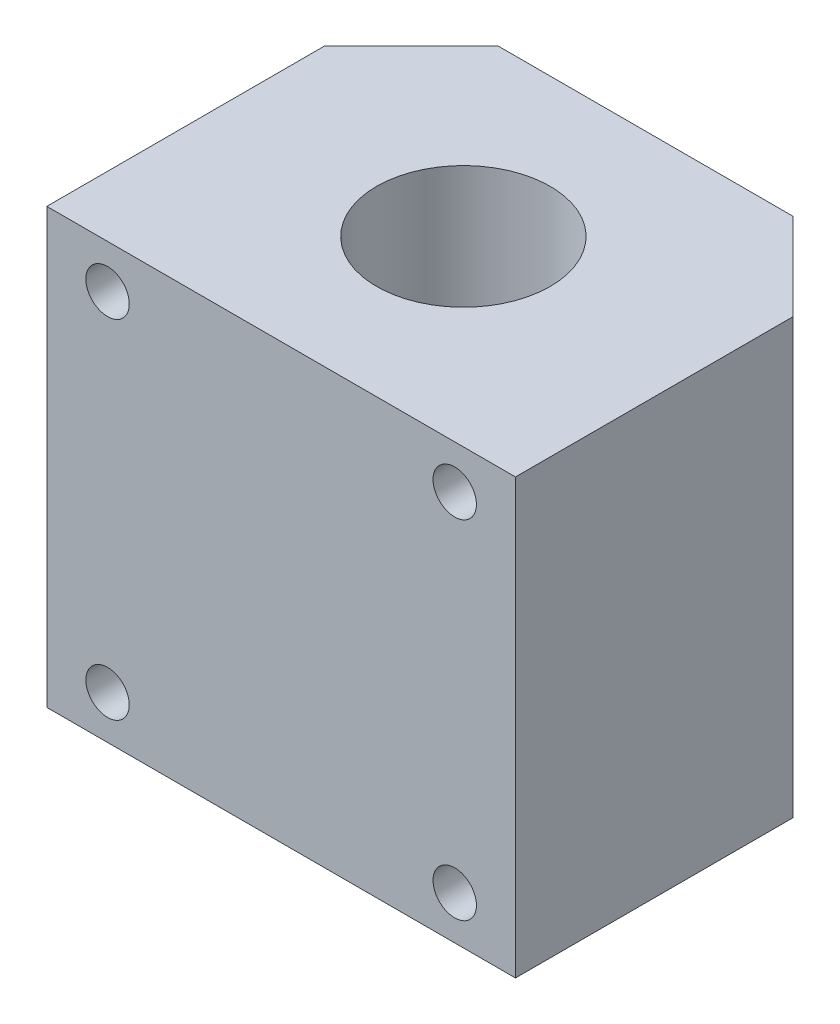
ISO-10303-21;
HEADER;
FILE_DESCRIPTION(('STEP AP214'),'2;1');
FILE_NAME('part.step','',(''),(''),'','','');
FILE_SCHEMA(('AUTOMOTIVE_DESIGN { 1 0 10303 214 1 1 1 1 }'));
ENDSEC;
DATA;
#1=APPLICATION_CONTEXT('core data for automotive mechanical design processes');
#2=APPLICATION_PROTOCOL_DEFINITION('international standard','automotive_design',2000,#1);
#3=PRODUCT_CONTEXT('',#1,'mechanical');
#4=PRODUCT('Part','Part','',(#3));
#5=PRODUCT_RELATED_PRODUCT_CATEGORY('part','',(#4));
#6=PRODUCT_DEFINITION_FORMATION('','',#4);
#7=PRODUCT_DEFINITION_CONTEXT('part definition',#1,'design');
#8=PRODUCT_DEFINITION('design','',#6,#7);
#9=PRODUCT_DEFINITION_SHAPE('','',#8);
#10=(LENGTH_UNIT() NAMED_UNIT(*) SI_UNIT(.MILLI.,.METRE.));
#11=(NAMED_UNIT(*) PLANE_ANGLE_UNIT() SI_UNIT($,.RADIAN.));
#12=(NAMED_UNIT(*) SI_UNIT($,.STERADIAN.) SOLID_ANGLE_UNIT());
#13=UNCERTAINTY_MEASURE_WITH_UNIT(LENGTH_MEASURE(1.E-05),#10,'distance_accuracy_value','');
#14=(GEOMETRIC_REPRESENTATION_CONTEXT(3) GLOBAL_UNCERTAINTY_ASSIGNED_CONTEXT((#13)) GLOBAL_UNIT_ASSIGNED_CONTEXT((#10,
#11,#12)) REPRESENTATION_CONTEXT('',''));
#15=CARTESIAN_POINT('',(0.,0.,0.));
#16=DIRECTION('',(0.,0.,1.));
#17=DIRECTION('',(1.,0.,0.));
#18=AXIS2_PLACEMENT_3D('',#15,#16,#17);
#19=CARTESIAN_POINT('',(-27.,-25.,42.));
#20=DIRECTION('',(1.,0.,0.));
#21=DIRECTION('',(0.,0.,-1.));
#22=AXIS2_PLACEMENT_3D('',#19,#20,#21);
#23=PLANE('',#22);
#24=DIRECTION('',(0.,0.,-1.));
#25=VECTOR('',#24,1.);
#26=CARTESIAN_POINT('',(-27.,25.,42.));
#27=LINE('',#26,#25);
#28=CARTESIAN_POINT('',(-27.,25.,42.));
#29=VERTEX_POINT('',#28);
#30=CARTESIAN_POINT('',(-27.,25.,10.));
#31=VERTEX_POINT('',#30);
#32=EDGE_CURVE('E142',#29,#31,#27,.T.);
#33=ORIENTED_EDGE('',*,*,#32,.T.);
#34=DIRECTION('',(0.,-1.,0.));
#35=VECTOR('',#34,1.);
#36=CARTESIAN_POINT('',(-27.,-25.,10.));
#37=LINE('',#36,#35);
#38=CARTESIAN_POINT('',(-27.,-25.,10.));
#39=VERTEX_POINT('',#38);
#40=EDGE_CURVE('E11',#31,#39,#37,.T.);
#41=ORIENTED_EDGE('',*,*,#40,.T.);
#42=DIRECTION('',(0.,0.,-1.));
#43=VECTOR('',#42,1.);
#44=CARTESIAN_POINT('',(-27.,-25.,42.));
#45=LINE('',#44,#43);
#46=CARTESIAN_POINT('',(-27.,-25.,42.));
#47=VERTEX_POINT('',#46);
#48=EDGE_CURVE('E91',#47,#39,#45,.T.);
#49=ORIENTED_EDGE('',*,*,#48,.F.);
#50=DIRECTION('',(0.,-1.,0.));
#51=VECTOR('',#50,1.);
#52=CARTESIAN_POINT('',(-27.,-25.,42.));
#53=LINE('',#52,#51);
#54=EDGE_CURVE('E97',#29,#47,#53,.T.);
#55=ORIENTED_EDGE('',*,*,#54,.F.);
#56=EDGE_LOOP('',(#33,#41,#49,#55));
#57=FACE_BOUND('',#56,.T.);
#58=ADVANCED_FACE('F32',(#57),#23,.F.);
#59=CARTESIAN_POINT('',(27.,-25.,42.));
#60=DIRECTION('',(0.,1.,0.));
#61=DIRECTION('',(-1.,0.,0.));
#62=AXIS2_PLACEMENT_3D('',#59,#60,#61);
#63=PLANE('',#62);
#64=CARTESIAN_POINT('',(0.,-25.,21.));
#65=DIRECTION('',(0.,1.,0.));
#66=DIRECTION('',(-1.,0.,0.));
#67=AXIS2_PLACEMENT_3D('',#64,#65,#66);
#68=CIRCLE('',#67,10.);
#69=CARTESIAN_POINT('',(-10.,-25.,21.));
#70=VERTEX_POINT('',#69);
#71=EDGE_CURVE('E138',#70,#70,#68,.T.);
#72=ORIENTED_EDGE('',*,*,#71,.T.);
#73=EDGE_LOOP('',(#72));
#74=FACE_BOUND('',#73,.T.);
#75=DIRECTION('',(1.,0.,0.));
#76=VECTOR('',#75,1.);
#77=CARTESIAN_POINT('',(27.,-25.,0.));
#78=LINE('',#77,#76);
#79=CARTESIAN_POINT('',(-17.,-25.,0.));
#80=VERTEX_POINT('',#79);
#81=CARTESIAN_POINT('',(17.,-25.,0.));
#82=VERTEX_POINT('',#81);
#83=EDGE_CURVE('E124',#80,#82,#78,.T.);
#84=ORIENTED_EDGE('',*,*,#83,.T.);
#85=DIRECTION('',(-0.707106781186549,0.,-0.707106781186547));
#86=VECTOR('',#85,1.);
#87=CARTESIAN_POINT('',(27.,-25.,10.));
#88=LINE('',#87,#86);
#89=CARTESIAN_POINT('',(27.,-25.,10.));
#90=VERTEX_POINT('',#89);
#91=EDGE_CURVE('E40',#82,#90,#88,.F.);
#92=ORIENTED_EDGE('',*,*,#91,.T.);
#93=DIRECTION('',(0.,0.,-1.));
#94=VECTOR('',#93,1.);
#95=CARTESIAN_POINT('',(27.,-25.,42.));
#96=LINE('',#95,#94);
#97=CARTESIAN_POINT('',(27.,-25.,42.));
#98=VERTEX_POINT('',#97);
#99=EDGE_CURVE('E93',#98,#90,#96,.T.);
#100=ORIENTED_EDGE('',*,*,#99,.F.);
#101=DIRECTION('',(1.,0.,0.));
#102=VECTOR('',#101,1.);
#103=CARTESIAN_POINT('',(27.,-25.,42.));
#104=LINE('',#103,#102);
#105=EDGE_CURVE('E87',#47,#98,#104,.T.);
#106=ORIENTED_EDGE('',*,*,#105,.F.);
#107=ORIENTED_EDGE('',*,*,#48,.T.);
#108=DIRECTION('',(-0.707106781186549,0.,0.707106781186547));
#109=VECTOR('',#108,1.);
#110=CARTESIAN_POINT('',(-27.,-25.,10.));
#111=LINE('',#110,#109);
#112=EDGE_CURVE('E47',#39,#80,#111,.F.);
#113=ORIENTED_EDGE('',*,*,#112,.T.);
#114=EDGE_LOOP('',(#84,#92,#100,#106,#107,#113));
#115=FACE_BOUND('',#114,.T.);
#116=ADVANCED_FACE('F89',(#74,#115),#63,.F.);
#117=CARTESIAN_POINT('',(27.,-25.,42.));
#118=DIRECTION('',(-1.,0.,0.));
#119=DIRECTION('',(0.,0.,1.));
#120=AXIS2_PLACEMENT_3D('',#117,#118,#119);
#121=PLANE('',#120);
#122=ORIENTED_EDGE('',*,*,#99,.T.);
#123=DIRECTION('',(0.,1.,0.));
#124=VECTOR('',#123,1.);
#125=CARTESIAN_POINT('',(27.,-25.,10.));
#126=LINE('',#125,#124);
#127=CARTESIAN_POINT('',(27.,25.,10.));
#128=VERTEX_POINT('',#127);
#129=EDGE_CURVE('E108',#90,#128,#126,.T.);
#130=ORIENTED_EDGE('',*,*,#129,.T.);
#131=DIRECTION('',(0.,0.,-1.));
#132=VECTOR('',#131,1.);
#133=CARTESIAN_POINT('',(27.,25.,42.));
#134=LINE('',#133,#132);
#135=CARTESIAN_POINT('',(27.,25.,42.));
#136=VERTEX_POINT('',#135);
#137=EDGE_CURVE('E113',#136,#128,#134,.T.);
#138=ORIENTED_EDGE('',*,*,#137,.F.);
#139=DIRECTION('',(0.,1.,0.));
#140=VECTOR('',#139,1.);
#141=CARTESIAN_POINT('',(27.,-25.,42.));
#142=LINE('',#141,#140);
#143=EDGE_CURVE('E96',#98,#136,#142,.T.);
#144=ORIENTED_EDGE('',*,*,#143,.F.);
#145=EDGE_LOOP('',(#122,#130,#138,#144));
#146=FACE_BOUND('',#145,.T.);
#147=ADVANCED_FACE('F128',(#146),#121,.F.);
#148=CARTESIAN_POINT('',(27.,25.,42.));
#149=DIRECTION('',(0.,-1.,0.));
#150=DIRECTION('',(1.,0.,0.));
#151=AXIS2_PLACEMENT_3D('',#148,#149,#150);
#152=PLANE('',#151);
#153=CARTESIAN_POINT('',(0.,25.,21.));
#154=DIRECTION('',(0.,1.,0.));
#155=DIRECTION('',(-1.,0.,0.));
#156=AXIS2_PLACEMENT_3D('',#153,#154,#155);
#157=CIRCLE('',#156,10.);
#158=CARTESIAN_POINT('',(-10.,25.,21.));
#159=VERTEX_POINT('',#158);
#160=EDGE_CURVE('E145',#159,#159,#157,.T.);
#161=ORIENTED_EDGE('',*,*,#160,.F.);
#162=EDGE_LOOP('',(#161));
#163=FACE_BOUND('',#162,.T.);
#164=ORIENTED_EDGE('',*,*,#137,.T.);
#165=DIRECTION('',(0.707106781186549,0.,0.707106781186547));
#166=VECTOR('',#165,1.);
#167=CARTESIAN_POINT('',(27.,25.,10.));
#168=LINE('',#167,#166);
#169=CARTESIAN_POINT('',(17.,25.,0.));
#170=VERTEX_POINT('',#169);
#171=EDGE_CURVE('E118',#128,#170,#168,.F.);
#172=ORIENTED_EDGE('',*,*,#171,.T.);
#173=DIRECTION('',(-1.,0.,0.));
#174=VECTOR('',#173,1.);
#175=CARTESIAN_POINT('',(27.,25.,0.));
#176=LINE('',#175,#174);
#177=CARTESIAN_POINT('',(-17.,25.,0.));
#178=VERTEX_POINT('',#177);
#179=EDGE_CURVE('E106',#170,#178,#176,.T.);
#180=ORIENTED_EDGE('',*,*,#179,.T.);
#181=DIRECTION('',(0.707106781186549,0.,-0.707106781186547));
#182=VECTOR('',#181,1.);
#183=CARTESIAN_POINT('',(-27.,25.,10.));
#184=LINE('',#183,#182);
#185=EDGE_CURVE('E111',#178,#31,#184,.F.);
#186=ORIENTED_EDGE('',*,*,#185,.T.);
#187=ORIENTED_EDGE('',*,*,#32,.F.);
#188=DIRECTION('',(-1.,0.,0.));
#189=VECTOR('',#188,1.);
#190=CARTESIAN_POINT('',(27.,25.,42.));
#191=LINE('',#190,#189);
#192=EDGE_CURVE('E102',#136,#29,#191,.T.);
#193=ORIENTED_EDGE('',*,*,#192,.F.);
#194=EDGE_LOOP('',(#164,#172,#180,#186,#187,#193));
#195=FACE_BOUND('',#194,.T.);
#196=ADVANCED_FACE('F134',(#163,#195),#152,.F.);
#197=CARTESIAN_POINT('',(0.,0.,42.));
#198=DIRECTION('',(0.,0.,1.));
#199=DIRECTION('',(1.,0.,0.));
#200=AXIS2_PLACEMENT_3D('',#197,#198,#199);
#201=PLANE('',#200);
#202=CARTESIAN_POINT('',(20.,-20.,42.));
#203=DIRECTION('',(0.,0.,1.));
#204=DIRECTION('',(1.,0.,0.));
#205=AXIS2_PLACEMENT_3D('',#202,#203,#204);
#206=CIRCLE('',#205,2.5);
#207=CARTESIAN_POINT('',(22.5,-20.,42.));
#208=VERTEX_POINT('',#207);
#209=EDGE_CURVE('E169',#208,#208,#206,.T.);
#210=ORIENTED_EDGE('',*,*,#209,.F.);
#211=EDGE_LOOP('',(#210));
#212=FACE_BOUND('',#211,.T.);
#213=CARTESIAN_POINT('',(-20.,-20.,42.));
#214=DIRECTION('',(0.,0.,1.));
#215=DIRECTION('',(1.,0.,0.));
#216=AXIS2_PLACEMENT_3D('',#213,#214,#215);
#217=CIRCLE('',#216,2.5);
#218=CARTESIAN_POINT('',(-17.5,-20.,42.));
#219=VERTEX_POINT('',#218);
#220=EDGE_CURVE('E163',#219,#219,#217,.T.);
#221=ORIENTED_EDGE('',*,*,#220,.F.);
#222=EDGE_LOOP('',(#221));
#223=FACE_BOUND('',#222,.T.);
#224=CARTESIAN_POINT('',(20.,20.,42.));
#225=DIRECTION('',(0.,0.,1.));
#226=DIRECTION('',(1.,0.,0.));
#227=AXIS2_PLACEMENT_3D('',#224,#225,#226);
#228=CIRCLE('',#227,2.5);
#229=CARTESIAN_POINT('',(22.5,20.,42.));
#230=VERTEX_POINT('',#229);
#231=EDGE_CURVE('E157',#230,#230,#228,.T.);
#232=ORIENTED_EDGE('',*,*,#231,.F.);
#233=EDGE_LOOP('',(#232));
#234=FACE_BOUND('',#233,.T.);
#235=CARTESIAN_POINT('',(-20.,20.,42.));
#236=DIRECTION('',(0.,0.,1.));
#237=DIRECTION('',(1.,0.,0.));
#238=AXIS2_PLACEMENT_3D('',#235,#236,#237);
#239=CIRCLE('',#238,2.5);
#240=CARTESIAN_POINT('',(-17.5,20.,42.));
#241=VERTEX_POINT('',#240);
#242=EDGE_CURVE('E151',#241,#241,#239,.T.);
#243=ORIENTED_EDGE('',*,*,#242,.F.);
#244=EDGE_LOOP('',(#243));
#245=FACE_BOUND('',#244,.T.);
#246=ORIENTED_EDGE('',*,*,#54,.T.);
#247=ORIENTED_EDGE('',*,*,#105,.T.);
#248=ORIENTED_EDGE('',*,*,#143,.T.);
#249=ORIENTED_EDGE('',*,*,#192,.T.);
#250=EDGE_LOOP('',(#246,#247,#248,#249));
#251=FACE_BOUND('',#250,.T.);
#252=ADVANCED_FACE('F100',(#212,#223,#234,#245,#251),#201,.T.);
#253=CARTESIAN_POINT('',(0.,0.,0.));
#254=DIRECTION('',(0.,0.,1.));
#255=DIRECTION('',(1.,0.,0.));
#256=AXIS2_PLACEMENT_3D('',#253,#254,#255);
#257=PLANE('',#256);
#258=ORIENTED_EDGE('',*,*,#179,.F.);
#259=DIRECTION('',(0.,-1.,0.));
#260=VECTOR('',#259,1.);
#261=CARTESIAN_POINT('',(17.,0.,0.));
#262=LINE('',#261,#260);
#263=EDGE_CURVE('E54',#170,#82,#262,.T.);
#264=ORIENTED_EDGE('',*,*,#263,.T.);
#265=ORIENTED_EDGE('',*,*,#83,.F.);
#266=DIRECTION('',(0.,1.,0.));
#267=VECTOR('',#266,1.);
#268=CARTESIAN_POINT('',(-17.,0.,0.));
#269=LINE('',#268,#267);
#270=EDGE_CURVE('E120',#80,#178,#269,.T.);
#271=ORIENTED_EDGE('',*,*,#270,.T.);
#272=EDGE_LOOP('',(#258,#264,#265,#271));
#273=FACE_BOUND('',#272,.T.);
#274=ADVANCED_FACE('F136',(#273),#257,.F.);
#275=CARTESIAN_POINT('',(27.,-25.,10.));
#276=DIRECTION('',(-0.707106781186547,0.,0.707106781186549));
#277=DIRECTION('',(0.,1.,0.));
#278=AXIS2_PLACEMENT_3D('',#275,#276,#277);
#279=PLANE('',#278);
#280=ORIENTED_EDGE('',*,*,#91,.F.);
#281=ORIENTED_EDGE('',*,*,#263,.F.);
#282=ORIENTED_EDGE('',*,*,#171,.F.);
#283=ORIENTED_EDGE('',*,*,#129,.F.);
#284=EDGE_LOOP('',(#280,#281,#282,#283));
#285=FACE_BOUND('',#284,.T.);
#286=ADVANCED_FACE('F131',(#285),#279,.F.);
#287=CARTESIAN_POINT('',(-27.,-25.,10.));
#288=DIRECTION('',(0.707106781186547,0.,0.707106781186549));
#289=DIRECTION('',(0.,-1.,0.));
#290=AXIS2_PLACEMENT_3D('',#287,#288,#289);
#291=PLANE('',#290);
#292=ORIENTED_EDGE('',*,*,#185,.F.);
#293=ORIENTED_EDGE('',*,*,#270,.F.);
#294=ORIENTED_EDGE('',*,*,#112,.F.);
#295=ORIENTED_EDGE('',*,*,#40,.F.);
#296=EDGE_LOOP('',(#292,#293,#294,#295));
#297=FACE_BOUND('',#296,.T.);
#298=ADVANCED_FACE('F34',(#297),#291,.F.);
#299=CARTESIAN_POINT('',(0.,-25.,21.));
#300=DIRECTION('',(0.,1.,0.));
#301=DIRECTION('',(-1.,0.,0.));
#302=AXIS2_PLACEMENT_3D('',#299,#300,#301);
#303=CYLINDRICAL_SURFACE('',#302,10.);
#304=ORIENTED_EDGE('',*,*,#71,.F.);
#305=EDGE_LOOP('',(#304));
#306=FACE_BOUND('',#305,.T.);
#307=ORIENTED_EDGE('',*,*,#160,.T.);
#308=EDGE_LOOP('',(#307));
#309=FACE_BOUND('',#308,.T.);
#310=ADVANCED_FACE('F196',(#306,#309),#303,.F.);
#311=CARTESIAN_POINT('',(-20.,20.,27.));
#312=DIRECTION('',(0.,0.,1.));
#313=DIRECTION('',(1.,0.,0.));
#314=AXIS2_PLACEMENT_3D('',#311,#312,#313);
#315=CYLINDRICAL_SURFACE('',#314,2.5);
#316=CARTESIAN_POINT('',(-20.,20.,27.));
#317=DIRECTION('',(0.,0.,1.));
#318=DIRECTION('',(1.,0.,0.));
#319=AXIS2_PLACEMENT_3D('',#316,#317,#318);
#320=CIRCLE('',#319,2.5);
#321=CARTESIAN_POINT('',(-17.5,20.,27.));
#322=VERTEX_POINT('',#321);
#323=EDGE_CURVE('E148',#322,#322,#320,.T.);
#324=ORIENTED_EDGE('',*,*,#323,.F.);
#325=EDGE_LOOP('',(#324));
#326=FACE_BOUND('',#325,.T.);
#327=ORIENTED_EDGE('',*,*,#242,.T.);
#328=EDGE_LOOP('',(#327));
#329=FACE_BOUND('',#328,.T.);
#330=ADVANCED_FACE('F193',(#326,#329),#315,.F.);
#331=CARTESIAN_POINT('',(-20.,20.,27.));
#332=DIRECTION('',(0.,0.,1.));
#333=DIRECTION('',(1.,0.,0.));
#334=AXIS2_PLACEMENT_3D('',#331,#332,#333);
#335=PLANE('',#334);
#336=ORIENTED_EDGE('',*,*,#323,.T.);
#337=EDGE_LOOP('',(#336));
#338=FACE_BOUND('',#337,.T.);
#339=ADVANCED_FACE('F195',(#338),#335,.T.);
#340=CARTESIAN_POINT('',(20.,20.,27.));
#341=DIRECTION('',(0.,0.,1.));
#342=DIRECTION('',(1.,0.,0.));
#343=AXIS2_PLACEMENT_3D('',#340,#341,#342);
#344=CYLINDRICAL_SURFACE('',#343,2.5);
#345=CARTESIAN_POINT('',(20.,20.,27.));
#346=DIRECTION('',(0.,0.,1.));
#347=DIRECTION('',(1.,0.,0.));
#348=AXIS2_PLACEMENT_3D('',#345,#346,#347);
#349=CIRCLE('',#348,2.5);
#350=CARTESIAN_POINT('',(22.5,20.,27.));
#351=VERTEX_POINT('',#350);
#352=EDGE_CURVE('E154',#351,#351,#349,.T.);
#353=ORIENTED_EDGE('',*,*,#352,.F.);
#354=EDGE_LOOP('',(#353));
#355=FACE_BOUND('',#354,.T.);
#356=ORIENTED_EDGE('',*,*,#231,.T.);
#357=EDGE_LOOP('',(#356));
#358=FACE_BOUND('',#357,.T.);
#359=ADVANCED_FACE('F203',(#355,#358),#344,.F.);
#360=CARTESIAN_POINT('',(20.,20.,27.));
#361=DIRECTION('',(0.,0.,1.));
#362=DIRECTION('',(1.,0.,0.));
#363=AXIS2_PLACEMENT_3D('',#360,#361,#362);
#364=PLANE('',#363);
#365=ORIENTED_EDGE('',*,*,#352,.T.);
#366=EDGE_LOOP('',(#365));
#367=FACE_BOUND('',#366,.T.);
#368=ADVANCED_FACE('F264',(#367),#364,.T.);
#369=CARTESIAN_POINT('',(-20.,-20.,27.));
#370=DIRECTION('',(0.,0.,1.));
#371=DIRECTION('',(1.,0.,0.));
#372=AXIS2_PLACEMENT_3D('',#369,#370,#371);
#373=CYLINDRICAL_SURFACE('',#372,2.5);
#374=CARTESIAN_POINT('',(-20.,-20.,27.));
#375=DIRECTION('',(0.,0.,1.));
#376=DIRECTION('',(1.,0.,0.));
#377=AXIS2_PLACEMENT_3D('',#374,#375,#376);
#378=CIRCLE('',#377,2.5);
#379=CARTESIAN_POINT('',(-17.5,-20.,27.));
#380=VERTEX_POINT('',#379);
#381=EDGE_CURVE('E160',#380,#380,#378,.T.);
#382=ORIENTED_EDGE('',*,*,#381,.F.);
#383=EDGE_LOOP('',(#382));
#384=FACE_BOUND('',#383,.T.);
#385=ORIENTED_EDGE('',*,*,#220,.T.);
#386=EDGE_LOOP('',(#385));
#387=FACE_BOUND('',#386,.T.);
#388=ADVANCED_FACE('F274',(#384,#387),#373,.F.);
#389=CARTESIAN_POINT('',(-20.,-20.,27.));
#390=DIRECTION('',(0.,0.,1.));
#391=DIRECTION('',(1.,0.,0.));
#392=AXIS2_PLACEMENT_3D('',#389,#390,#391);
#393=PLANE('',#392);
#394=ORIENTED_EDGE('',*,*,#381,.T.);
#395=EDGE_LOOP('',(#394));
#396=FACE_BOUND('',#395,.T.);
#397=ADVANCED_FACE('F180',(#396),#393,.T.);
#398=CARTESIAN_POINT('',(20.,-20.,27.));
#399=DIRECTION('',(0.,0.,1.));
#400=DIRECTION('',(1.,0.,0.));
#401=AXIS2_PLACEMENT_3D('',#398,#399,#400);
#402=CYLINDRICAL_SURFACE('',#401,2.5);
#403=CARTESIAN_POINT('',(20.,-20.,27.));
#404=DIRECTION('',(0.,0.,1.));
#405=DIRECTION('',(1.,0.,0.));
#406=AXIS2_PLACEMENT_3D('',#403,#404,#405);
#407=CIRCLE('',#406,2.5);
#408=CARTESIAN_POINT('',(22.5,-20.,27.));
#409=VERTEX_POINT('',#408);
#410=EDGE_CURVE('E166',#409,#409,#407,.T.);
#411=ORIENTED_EDGE('',*,*,#410,.F.);
#412=EDGE_LOOP('',(#411));
#413=FACE_BOUND('',#412,.T.);
#414=ORIENTED_EDGE('',*,*,#209,.T.);
#415=EDGE_LOOP('',(#414));
#416=FACE_BOUND('',#415,.T.);
#417=ADVANCED_FACE('F177',(#413,#416),#402,.F.);
#418=CARTESIAN_POINT('',(20.,-20.,27.));
#419=DIRECTION('',(0.,0.,1.));
#420=DIRECTION('',(1.,0.,0.));
#421=AXIS2_PLACEMENT_3D('',#418,#419,#420);
#422=PLANE('',#421);
#423=ORIENTED_EDGE('',*,*,#410,.T.);
#424=EDGE_LOOP('',(#423));
#425=FACE_BOUND('',#424,.T.);
#426=ADVANCED_FACE('F175',(#425),#422,.T.);
#427=CLOSED_SHELL('',(#58,#116,#147,#196,#252,#274,#286,#298,#310,#330,#339,#359,#368,#388,#397,
#417,#426));
#428=MANIFOLD_SOLID_BREP('B2',#427);
#429=ADVANCED_BREP_SHAPE_REPRESENTATION('',(#18,#428),#14);
#430=SHAPE_DEFINITION_REPRESENTATION(#9,#429);
ENDSEC;
END-ISO-10303-21;
